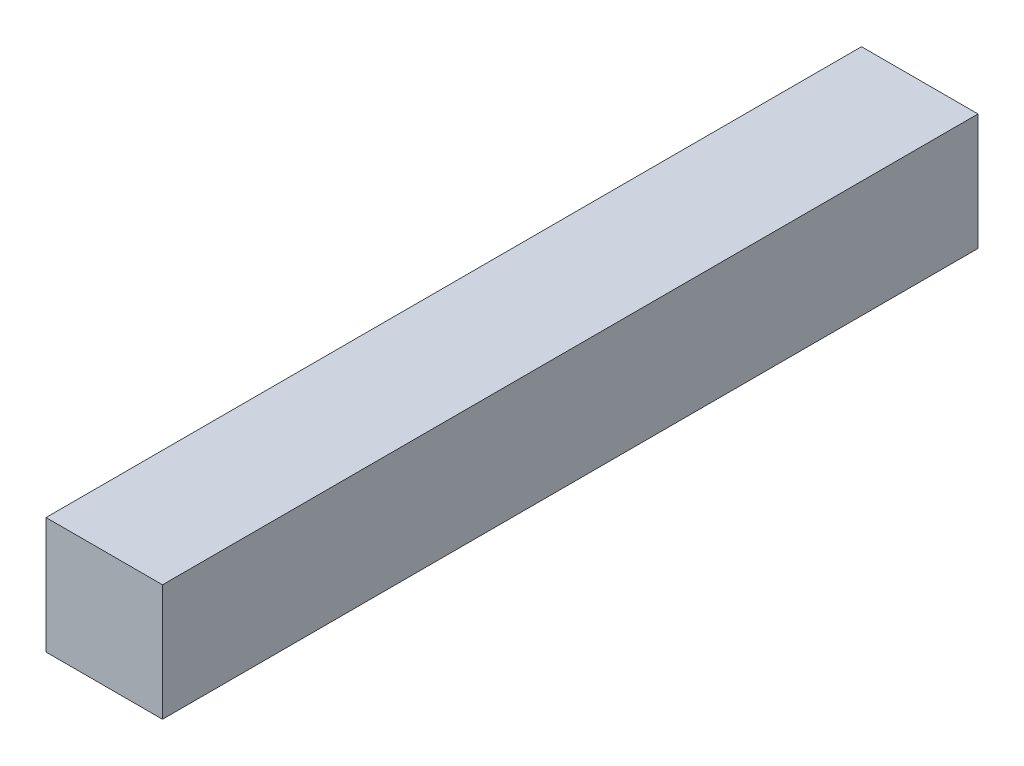
ISO-10303-21;
HEADER;
FILE_DESCRIPTION(('STEP AP214'),'2;1');
FILE_NAME('part.step','',(''),(''),'','','');
FILE_SCHEMA(('AUTOMOTIVE_DESIGN { 1 0 10303 214 1 1 1 1 }'));
ENDSEC;
DATA;
#1=APPLICATION_CONTEXT('core data for automotive mechanical design processes');
#2=APPLICATION_PROTOCOL_DEFINITION('international standard','automotive_design',2000,#1);
#3=PRODUCT_CONTEXT('',#1,'mechanical');
#4=PRODUCT('Part','Part','',(#3));
#5=PRODUCT_RELATED_PRODUCT_CATEGORY('part','',(#4));
#6=PRODUCT_DEFINITION_FORMATION('','',#4);
#7=PRODUCT_DEFINITION_CONTEXT('part definition',#1,'design');
#8=PRODUCT_DEFINITION('design','',#6,#7);
#9=PRODUCT_DEFINITION_SHAPE('','',#8);
#10=(LENGTH_UNIT() NAMED_UNIT(*) SI_UNIT(.MILLI.,.METRE.));
#11=(NAMED_UNIT(*) PLANE_ANGLE_UNIT() SI_UNIT($,.RADIAN.));
#12=(NAMED_UNIT(*) SI_UNIT($,.STERADIAN.) SOLID_ANGLE_UNIT());
#13=UNCERTAINTY_MEASURE_WITH_UNIT(LENGTH_MEASURE(1.E-05),#10,'distance_accuracy_value','');
#14=(GEOMETRIC_REPRESENTATION_CONTEXT(3) GLOBAL_UNCERTAINTY_ASSIGNED_CONTEXT((#13)) GLOBAL_UNIT_ASSIGNED_CONTEXT((#10,
#11,#12)) REPRESENTATION_CONTEXT('',''));
#15=CARTESIAN_POINT('',(0.,0.,0.));
#16=DIRECTION('',(0.,0.,1.));
#17=DIRECTION('',(1.,0.,0.));
#18=AXIS2_PLACEMENT_3D('',#15,#16,#17);
#19=CARTESIAN_POINT('',(-49.6175402116986,18.1930980776228,70.));
#20=DIRECTION('',(1.,0.,0.));
#21=DIRECTION('',(0.,0.,-1.));
#22=AXIS2_PLACEMENT_3D('',#19,#20,#21);
#23=PLANE('',#22);
#24=DIRECTION('',(0.,-1.,0.));
#25=VECTOR('',#24,1.);
#26=CARTESIAN_POINT('',(-49.6175402116986,18.1930980776228,0.));
#27=LINE('',#26,#25);
#28=CARTESIAN_POINT('',(-49.6175402116986,18.1930980776228,0.));
#29=VERTEX_POINT('',#28);
#30=CARTESIAN_POINT('',(-49.6175402116986,8.19309807762281,0.));
#31=VERTEX_POINT('',#30);
#32=EDGE_CURVE('E96',#29,#31,#27,.T.);
#33=ORIENTED_EDGE('',*,*,#32,.T.);
#34=DIRECTION('',(0.,0.,-1.));
#35=VECTOR('',#34,1.);
#36=CARTESIAN_POINT('',(-49.6175402116986,8.19309807762281,70.));
#37=LINE('',#36,#35);
#38=CARTESIAN_POINT('',(-49.6175402116986,8.19309807762281,70.));
#39=VERTEX_POINT('',#38);
#40=EDGE_CURVE('E11',#39,#31,#37,.T.);
#41=ORIENTED_EDGE('',*,*,#40,.F.);
#42=DIRECTION('',(0.,-1.,0.));
#43=VECTOR('',#42,1.);
#44=CARTESIAN_POINT('',(-49.6175402116986,18.1930980776228,70.));
#45=LINE('',#44,#43);
#46=CARTESIAN_POINT('',(-49.6175402116986,18.1930980776228,70.));
#47=VERTEX_POINT('',#46);
#48=EDGE_CURVE('E84',#47,#39,#45,.T.);
#49=ORIENTED_EDGE('',*,*,#48,.F.);
#50=DIRECTION('',(0.,0.,-1.));
#51=VECTOR('',#50,1.);
#52=CARTESIAN_POINT('',(-49.6175402116986,18.1930980776228,70.));
#53=LINE('',#52,#51);
#54=EDGE_CURVE('E92',#47,#29,#53,.T.);
#55=ORIENTED_EDGE('',*,*,#54,.T.);
#56=EDGE_LOOP('',(#33,#41,#49,#55));
#57=FACE_BOUND('',#56,.T.);
#58=ADVANCED_FACE('F33',(#57),#23,.F.);
#59=CARTESIAN_POINT('',(-49.6175402116986,8.19309807762281,70.));
#60=DIRECTION('',(0.,1.,0.));
#61=DIRECTION('',(0.,0.,1.));
#62=AXIS2_PLACEMENT_3D('',#59,#60,#61);
#63=PLANE('',#62);
#64=DIRECTION('',(1.,0.,0.));
#65=VECTOR('',#64,1.);
#66=CARTESIAN_POINT('',(-49.6175402116986,8.19309807762281,0.));
#67=LINE('',#66,#65);
#68=CARTESIAN_POINT('',(-39.6175402116986,8.19309807762281,0.));
#69=VERTEX_POINT('',#68);
#70=EDGE_CURVE('E88',#31,#69,#67,.T.);
#71=ORIENTED_EDGE('',*,*,#70,.T.);
#72=DIRECTION('',(0.,0.,-1.));
#73=VECTOR('',#72,1.);
#74=CARTESIAN_POINT('',(-39.6175402116986,8.19309807762281,70.));
#75=LINE('',#74,#73);
#76=CARTESIAN_POINT('',(-39.6175402116986,8.19309807762281,70.));
#77=VERTEX_POINT('',#76);
#78=EDGE_CURVE('E41',#77,#69,#75,.T.);
#79=ORIENTED_EDGE('',*,*,#78,.F.);
#80=DIRECTION('',(1.,0.,0.));
#81=VECTOR('',#80,1.);
#82=CARTESIAN_POINT('',(-49.6175402116986,8.19309807762281,70.));
#83=LINE('',#82,#81);
#84=EDGE_CURVE('E79',#39,#77,#83,.T.);
#85=ORIENTED_EDGE('',*,*,#84,.F.);
#86=ORIENTED_EDGE('',*,*,#40,.T.);
#87=EDGE_LOOP('',(#71,#79,#85,#86));
#88=FACE_BOUND('',#87,.T.);
#89=ADVANCED_FACE('F87',(#88),#63,.F.);
#90=CARTESIAN_POINT('',(-39.6175402116986,18.1930980776228,70.));
#91=DIRECTION('',(-1.,0.,0.));
#92=DIRECTION('',(0.,0.,1.));
#93=AXIS2_PLACEMENT_3D('',#90,#91,#92);
#94=PLANE('',#93);
#95=DIRECTION('',(0.,1.,0.));
#96=VECTOR('',#95,1.);
#97=CARTESIAN_POINT('',(-39.6175402116986,18.1930980776228,0.));
#98=LINE('',#97,#96);
#99=CARTESIAN_POINT('',(-39.6175402116986,18.1930980776228,0.));
#100=VERTEX_POINT('',#99);
#101=EDGE_CURVE('E66',#69,#100,#98,.T.);
#102=ORIENTED_EDGE('',*,*,#101,.T.);
#103=DIRECTION('',(0.,0.,-1.));
#104=VECTOR('',#103,1.);
#105=CARTESIAN_POINT('',(-39.6175402116986,18.1930980776228,70.));
#106=LINE('',#105,#104);
#107=CARTESIAN_POINT('',(-39.6175402116986,18.1930980776228,70.));
#108=VERTEX_POINT('',#107);
#109=EDGE_CURVE('E89',#108,#100,#106,.T.);
#110=ORIENTED_EDGE('',*,*,#109,.F.);
#111=DIRECTION('',(0.,1.,0.));
#112=VECTOR('',#111,1.);
#113=CARTESIAN_POINT('',(-39.6175402116986,18.1930980776228,70.));
#114=LINE('',#113,#112);
#115=EDGE_CURVE('E82',#77,#108,#114,.T.);
#116=ORIENTED_EDGE('',*,*,#115,.F.);
#117=ORIENTED_EDGE('',*,*,#78,.T.);
#118=EDGE_LOOP('',(#102,#110,#116,#117));
#119=FACE_BOUND('',#118,.T.);
#120=ADVANCED_FACE('F90',(#119),#94,.F.);
#121=CARTESIAN_POINT('',(-49.6175402116986,18.1930980776228,70.));
#122=DIRECTION('',(0.,-1.,0.));
#123=DIRECTION('',(0.,0.,-1.));
#124=AXIS2_PLACEMENT_3D('',#121,#122,#123);
#125=PLANE('',#124);
#126=DIRECTION('',(-1.,0.,0.));
#127=VECTOR('',#126,1.);
#128=CARTESIAN_POINT('',(-49.6175402116986,18.1930980776228,0.));
#129=LINE('',#128,#127);
#130=EDGE_CURVE('E72',#100,#29,#129,.T.);
#131=ORIENTED_EDGE('',*,*,#130,.T.);
#132=ORIENTED_EDGE('',*,*,#54,.F.);
#133=DIRECTION('',(-1.,0.,0.));
#134=VECTOR('',#133,1.);
#135=CARTESIAN_POINT('',(-49.6175402116986,18.1930980776228,70.));
#136=LINE('',#135,#134);
#137=EDGE_CURVE('E49',#108,#47,#136,.T.);
#138=ORIENTED_EDGE('',*,*,#137,.F.);
#139=ORIENTED_EDGE('',*,*,#109,.T.);
#140=EDGE_LOOP('',(#131,#132,#138,#139));
#141=FACE_BOUND('',#140,.T.);
#142=ADVANCED_FACE('F103',(#141),#125,.F.);
#143=CARTESIAN_POINT('',(0.,0.,70.));
#144=DIRECTION('',(0.,0.,1.));
#145=DIRECTION('',(1.,0.,0.));
#146=AXIS2_PLACEMENT_3D('',#143,#144,#145);
#147=PLANE('',#146);
#148=ORIENTED_EDGE('',*,*,#48,.T.);
#149=ORIENTED_EDGE('',*,*,#84,.T.);
#150=ORIENTED_EDGE('',*,*,#115,.T.);
#151=ORIENTED_EDGE('',*,*,#137,.T.);
#152=EDGE_LOOP('',(#148,#149,#150,#151));
#153=FACE_BOUND('',#152,.T.);
#154=ADVANCED_FACE('F80',(#153),#147,.T.);
#155=CARTESIAN_POINT('',(0.,0.,0.));
#156=DIRECTION('',(0.,0.,1.));
#157=DIRECTION('',(1.,0.,0.));
#158=AXIS2_PLACEMENT_3D('',#155,#156,#157);
#159=PLANE('',#158);
#160=ORIENTED_EDGE('',*,*,#32,.F.);
#161=ORIENTED_EDGE('',*,*,#130,.F.);
#162=ORIENTED_EDGE('',*,*,#101,.F.);
#163=ORIENTED_EDGE('',*,*,#70,.F.);
#164=EDGE_LOOP('',(#160,#161,#162,#163));
#165=FACE_BOUND('',#164,.T.);
#166=ADVANCED_FACE('F106',(#165),#159,.F.);
#167=CLOSED_SHELL('',(#58,#89,#120,#142,#154,#166));
#168=MANIFOLD_SOLID_BREP('B2',#167);
#169=ADVANCED_BREP_SHAPE_REPRESENTATION('',(#18,#168),#14);
#170=SHAPE_DEFINITION_REPRESENTATION(#9,#169);
ENDSEC;
END-ISO-10303-21;
